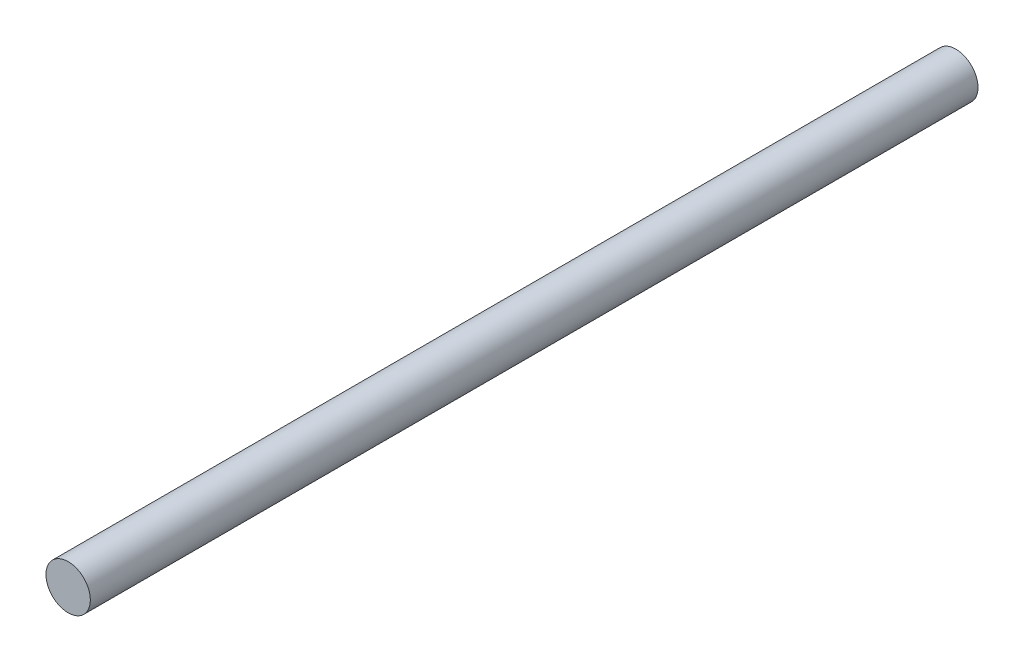
ISO-10303-21;
HEADER;
FILE_DESCRIPTION(('STEP AP214'),'2;1');
FILE_NAME('part.step','',(''),(''),'','','');
FILE_SCHEMA(('AUTOMOTIVE_DESIGN { 1 0 10303 214 1 1 1 1 }'));
ENDSEC;
DATA;
#1=APPLICATION_CONTEXT('core data for automotive mechanical design processes');
#2=APPLICATION_PROTOCOL_DEFINITION('international standard','automotive_design',2000,#1);
#3=PRODUCT_CONTEXT('',#1,'mechanical');
#4=PRODUCT('Part','Part','',(#3));
#5=PRODUCT_RELATED_PRODUCT_CATEGORY('part','',(#4));
#6=PRODUCT_DEFINITION_FORMATION('','',#4);
#7=PRODUCT_DEFINITION_CONTEXT('part definition',#1,'design');
#8=PRODUCT_DEFINITION('design','',#6,#7);
#9=PRODUCT_DEFINITION_SHAPE('','',#8);
#10=(LENGTH_UNIT() NAMED_UNIT(*) SI_UNIT(.MILLI.,.METRE.));
#11=(NAMED_UNIT(*) PLANE_ANGLE_UNIT() SI_UNIT($,.RADIAN.));
#12=(NAMED_UNIT(*) SI_UNIT($,.STERADIAN.) SOLID_ANGLE_UNIT());
#13=UNCERTAINTY_MEASURE_WITH_UNIT(LENGTH_MEASURE(1.E-05),#10,'distance_accuracy_value','');
#14=(GEOMETRIC_REPRESENTATION_CONTEXT(3) GLOBAL_UNCERTAINTY_ASSIGNED_CONTEXT((#13)) GLOBAL_UNIT_ASSIGNED_CONTEXT((#10,
#11,#12)) REPRESENTATION_CONTEXT('',''));
#15=CARTESIAN_POINT('',(0.,0.,0.));
#16=DIRECTION('',(0.,0.,1.));
#17=DIRECTION('',(1.,0.,0.));
#18=AXIS2_PLACEMENT_3D('',#15,#16,#17);
#19=CARTESIAN_POINT('',(0.,0.,240.));
#20=DIRECTION('',(0.,0.,-1.));
#21=DIRECTION('',(-1.,0.,0.));
#22=AXIS2_PLACEMENT_3D('',#19,#20,#21);
#23=CYLINDRICAL_SURFACE('',#22,6.);
#24=CARTESIAN_POINT('',(0.,0.,240.));
#25=DIRECTION('',(0.,0.,1.));
#26=DIRECTION('',(1.,0.,0.));
#27=AXIS2_PLACEMENT_3D('',#24,#25,#26);
#28=CIRCLE('',#27,6.);
#29=CARTESIAN_POINT('',(6.,0.,240.));
#30=VERTEX_POINT('',#29);
#31=EDGE_CURVE('E10',#30,#30,#28,.T.);
#32=ORIENTED_EDGE('',*,*,#31,.F.);
#33=EDGE_LOOP('',(#32));
#34=FACE_BOUND('',#33,.T.);
#35=CARTESIAN_POINT('',(0.,0.,0.));
#36=DIRECTION('',(0.,0.,1.));
#37=DIRECTION('',(1.,0.,0.));
#38=AXIS2_PLACEMENT_3D('',#35,#36,#37);
#39=CIRCLE('',#38,6.);
#40=CARTESIAN_POINT('',(6.,0.,0.));
#41=VERTEX_POINT('',#40);
#42=EDGE_CURVE('E35',#41,#41,#39,.T.);
#43=ORIENTED_EDGE('',*,*,#42,.T.);
#44=EDGE_LOOP('',(#43));
#45=FACE_BOUND('',#44,.T.);
#46=ADVANCED_FACE('F32',(#34,#45),#23,.T.);
#47=CARTESIAN_POINT('',(0.,0.,240.));
#48=DIRECTION('',(0.,0.,1.));
#49=DIRECTION('',(1.,0.,0.));
#50=AXIS2_PLACEMENT_3D('',#47,#48,#49);
#51=PLANE('',#50);
#52=ORIENTED_EDGE('',*,*,#31,.T.);
#53=EDGE_LOOP('',(#52));
#54=FACE_BOUND('',#53,.T.);
#55=ADVANCED_FACE('F47',(#54),#51,.T.);
#56=CARTESIAN_POINT('',(0.,0.,0.));
#57=DIRECTION('',(0.,0.,1.));
#58=DIRECTION('',(1.,0.,0.));
#59=AXIS2_PLACEMENT_3D('',#56,#57,#58);
#60=PLANE('',#59);
#61=ORIENTED_EDGE('',*,*,#42,.F.);
#62=EDGE_LOOP('',(#61));
#63=FACE_BOUND('',#62,.T.);
#64=ADVANCED_FACE('F45',(#63),#60,.F.);
#65=CLOSED_SHELL('',(#46,#55,#64));
#66=MANIFOLD_SOLID_BREP('B2',#65);
#67=ADVANCED_BREP_SHAPE_REPRESENTATION('',(#18,#66),#14);
#68=SHAPE_DEFINITION_REPRESENTATION(#9,#67);
ENDSEC;
END-ISO-10303-21;
